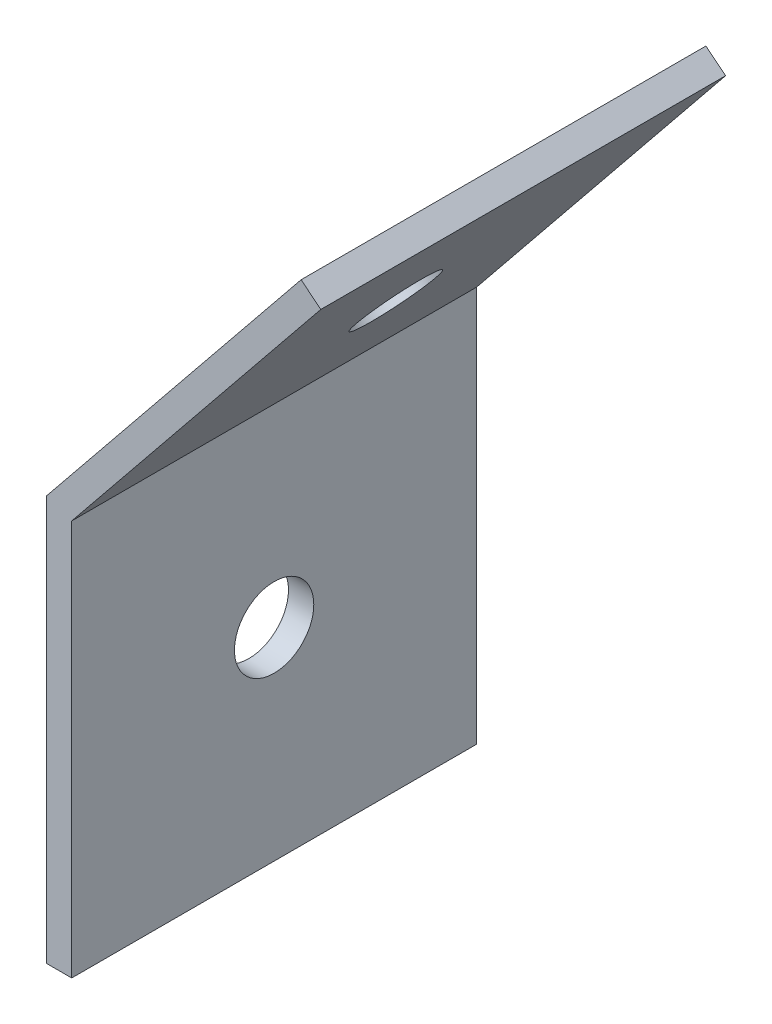
ISO-10303-21;
HEADER;
FILE_DESCRIPTION(('STEP AP214'),'2;1');
FILE_NAME('part.step','',(''),(''),'','','');
FILE_SCHEMA(('AUTOMOTIVE_DESIGN { 1 0 10303 214 1 1 1 1 }'));
ENDSEC;
DATA;
#1=APPLICATION_CONTEXT('core data for automotive mechanical design processes');
#2=APPLICATION_PROTOCOL_DEFINITION('international standard','automotive_design',2000,#1);
#3=PRODUCT_CONTEXT('',#1,'mechanical');
#4=PRODUCT('Part','Part','',(#3));
#5=PRODUCT_RELATED_PRODUCT_CATEGORY('part','',(#4));
#6=PRODUCT_DEFINITION_FORMATION('','',#4);
#7=PRODUCT_DEFINITION_CONTEXT('part definition',#1,'design');
#8=PRODUCT_DEFINITION('design','',#6,#7);
#9=PRODUCT_DEFINITION_SHAPE('','',#8);
#10=(LENGTH_UNIT() NAMED_UNIT(*) SI_UNIT(.MILLI.,.METRE.));
#11=(NAMED_UNIT(*) PLANE_ANGLE_UNIT() SI_UNIT($,.RADIAN.));
#12=(NAMED_UNIT(*) SI_UNIT($,.STERADIAN.) SOLID_ANGLE_UNIT());
#13=UNCERTAINTY_MEASURE_WITH_UNIT(LENGTH_MEASURE(1.E-05),#10,'distance_accuracy_value','');
#14=(GEOMETRIC_REPRESENTATION_CONTEXT(3) GLOBAL_UNCERTAINTY_ASSIGNED_CONTEXT((#13)) GLOBAL_UNIT_ASSIGNED_CONTEXT((#10,
#11,#12)) REPRESENTATION_CONTEXT('',''));
#15=CARTESIAN_POINT('',(0.,0.,0.));
#16=DIRECTION('',(0.,0.,1.));
#17=DIRECTION('',(1.,0.,0.));
#18=AXIS2_PLACEMENT_3D('',#15,#16,#17);
#19=CARTESIAN_POINT('',(0.,0.,-25.4));
#20=DIRECTION('',(-1.,0.,0.));
#21=DIRECTION('',(0.,-1.,0.));
#22=AXIS2_PLACEMENT_3D('',#19,#20,#21);
#23=PLANE('',#22);
#24=CARTESIAN_POINT('',(0.,-12.7,-12.7));
#25=DIRECTION('',(-1.,0.,0.));
#26=DIRECTION('',(0.,-1.,0.));
#27=AXIS2_PLACEMENT_3D('',#24,#25,#26);
#28=CIRCLE('',#27,2.48919999999999);
#29=CARTESIAN_POINT('',(0.,-15.1892,-12.7));
#30=VERTEX_POINT('',#29);
#31=EDGE_CURVE('E185',#30,#30,#28,.T.);
#32=ORIENTED_EDGE('',*,*,#31,.F.);
#33=EDGE_LOOP('',(#32));
#34=FACE_BOUND('',#33,.T.);
#35=DIRECTION('',(0.,-1.,0.));
#36=VECTOR('',#35,1.);
#37=CARTESIAN_POINT('',(0.,0.,0.));
#38=LINE('',#37,#36);
#39=CARTESIAN_POINT('',(0.,0.,0.));
#40=VERTEX_POINT('',#39);
#41=CARTESIAN_POINT('',(0.,-25.4,0.));
#42=VERTEX_POINT('',#41);
#43=EDGE_CURVE('E116',#40,#42,#38,.T.);
#44=ORIENTED_EDGE('',*,*,#43,.F.);
#45=DIRECTION('',(0.,0.,1.));
#46=VECTOR('',#45,1.);
#47=CARTESIAN_POINT('',(0.,0.,-25.4));
#48=LINE('',#47,#46);
#49=CARTESIAN_POINT('',(0.,0.,-25.4));
#50=VERTEX_POINT('',#49);
#51=EDGE_CURVE('E11',#50,#40,#48,.T.);
#52=ORIENTED_EDGE('',*,*,#51,.F.);
#53=DIRECTION('',(0.,-1.,0.));
#54=VECTOR('',#53,1.);
#55=CARTESIAN_POINT('',(0.,0.,-25.4));
#56=LINE('',#55,#54);
#57=CARTESIAN_POINT('',(0.,-25.4,-25.4));
#58=VERTEX_POINT('',#57);
#59=EDGE_CURVE('E130',#50,#58,#56,.T.);
#60=ORIENTED_EDGE('',*,*,#59,.T.);
#61=DIRECTION('',(0.,0.,1.));
#62=VECTOR('',#61,1.);
#63=CARTESIAN_POINT('',(0.,-25.4,-25.4));
#64=LINE('',#63,#62);
#65=EDGE_CURVE('E37',#58,#42,#64,.T.);
#66=ORIENTED_EDGE('',*,*,#65,.T.);
#67=EDGE_LOOP('',(#44,#52,#60,#66));
#68=FACE_BOUND('',#67,.T.);
#69=ADVANCED_FACE('F34',(#34,#68),#23,.T.);
#70=CARTESIAN_POINT('',(0.,0.,-25.4));
#71=DIRECTION('',(-0.777233462324333,0.629212321115321,0.));
#72=DIRECTION('',(-0.629212321115321,-0.777233462324333,0.));
#73=AXIS2_PLACEMENT_3D('',#70,#71,#72);
#74=PLANE('',#73);
#75=CARTESIAN_POINT('',(7.99099647816458,9.87086497151904,-12.7));
#76=DIRECTION('',(-0.777233462324333,0.629212321115321,0.));
#77=DIRECTION('',(-0.629212321115321,-0.777233462324333,0.));
#78=AXIS2_PLACEMENT_3D('',#75,#76,#77);
#79=CIRCLE('',#78,2.48919999999999);
#80=CARTESIAN_POINT('',(6.42476116844433,7.93617543710132,-12.7));
#81=VERTEX_POINT('',#80);
#82=EDGE_CURVE('E120',#81,#81,#79,.T.);
#83=ORIENTED_EDGE('',*,*,#82,.F.);
#84=EDGE_LOOP('',(#83));
#85=FACE_BOUND('',#84,.T.);
#86=DIRECTION('',(-0.629212321115321,-0.777233462324333,0.));
#87=VECTOR('',#86,1.);
#88=CARTESIAN_POINT('',(0.,0.,0.));
#89=LINE('',#88,#87);
#90=CARTESIAN_POINT('',(15.9819929563291,19.7417299430381,0.));
#91=VERTEX_POINT('',#90);
#92=EDGE_CURVE('E128',#91,#40,#89,.T.);
#93=ORIENTED_EDGE('',*,*,#92,.F.);
#94=DIRECTION('',(0.,0.,1.));
#95=VECTOR('',#94,1.);
#96=CARTESIAN_POINT('',(15.9819929563291,19.7417299430381,-25.4));
#97=LINE('',#96,#95);
#98=CARTESIAN_POINT('',(15.9819929563291,19.7417299430381,-25.4));
#99=VERTEX_POINT('',#98);
#100=EDGE_CURVE('E43',#99,#91,#97,.T.);
#101=ORIENTED_EDGE('',*,*,#100,.F.);
#102=DIRECTION('',(-0.629212321115321,-0.777233462324333,0.));
#103=VECTOR('',#102,1.);
#104=CARTESIAN_POINT('',(0.,0.,-25.4));
#105=LINE('',#104,#103);
#106=EDGE_CURVE('E97',#99,#50,#105,.T.);
#107=ORIENTED_EDGE('',*,*,#106,.T.);
#108=ORIENTED_EDGE('',*,*,#51,.T.);
#109=EDGE_LOOP('',(#93,#101,#107,#108));
#110=FACE_BOUND('',#109,.T.);
#111=ADVANCED_FACE('F142',(#85,#110),#74,.T.);
#112=CARTESIAN_POINT('',(15.9819929563291,19.7417299430381,-25.4));
#113=DIRECTION('',(-0.629212321115316,-0.777233462324337,0.));
#114=DIRECTION('',(0.777233462324337,-0.629212321115316,0.));
#115=AXIS2_PLACEMENT_3D('',#112,#113,#114);
#116=PLANE('',#115);
#117=DIRECTION('',(0.777233462324337,-0.629212321115316,0.));
#118=VECTOR('',#117,1.);
#119=CARTESIAN_POINT('',(15.9819929563291,19.7417299430381,0.));
#120=LINE('',#119,#118);
#121=CARTESIAN_POINT('',(17.215851077769,18.7428553832675,0.));
#122=VERTEX_POINT('',#121);
#123=EDGE_CURVE('E102',#91,#122,#120,.T.);
#124=ORIENTED_EDGE('',*,*,#123,.T.);
#125=DIRECTION('',(0.,0.,1.));
#126=VECTOR('',#125,1.);
#127=CARTESIAN_POINT('',(17.215851077769,18.7428553832675,-25.4));
#128=LINE('',#127,#126);
#129=CARTESIAN_POINT('',(17.215851077769,18.7428553832675,-25.4));
#130=VERTEX_POINT('',#129);
#131=EDGE_CURVE('E100',#130,#122,#128,.T.);
#132=ORIENTED_EDGE('',*,*,#131,.F.);
#133=DIRECTION('',(0.777233462324337,-0.629212321115316,0.));
#134=VECTOR('',#133,1.);
#135=CARTESIAN_POINT('',(15.9819929563291,19.7417299430381,-25.4));
#136=LINE('',#135,#134);
#137=EDGE_CURVE('E91',#99,#130,#136,.T.);
#138=ORIENTED_EDGE('',*,*,#137,.F.);
#139=ORIENTED_EDGE('',*,*,#100,.T.);
#140=EDGE_LOOP('',(#124,#132,#138,#139));
#141=FACE_BOUND('',#140,.T.);
#142=ADVANCED_FACE('F101',(#141),#116,.F.);
#143=CARTESIAN_POINT('',(1.23385812143988,-0.998874559770572,-25.4));
#144=DIRECTION('',(-0.777233462324333,0.629212321115321,0.));
#145=DIRECTION('',(-0.629212321115321,-0.777233462324333,0.));
#146=AXIS2_PLACEMENT_3D('',#143,#144,#145);
#147=PLANE('',#146);
#148=CARTESIAN_POINT('',(9.22485459960446,8.87199041174847,-12.7));
#149=DIRECTION('',(0.777233462324333,-0.629212321115321,0.));
#150=DIRECTION('',(0.629212321115321,0.777233462324333,0.));
#151=AXIS2_PLACEMENT_3D('',#148,#149,#150);
#152=CIRCLE('',#151,2.48919999999999);
#153=CARTESIAN_POINT('',(10.7910899093247,10.8066799461662,-12.7));
#154=VERTEX_POINT('',#153);
#155=EDGE_CURVE('E186',#154,#154,#152,.T.);
#156=ORIENTED_EDGE('',*,*,#155,.F.);
#157=EDGE_LOOP('',(#156));
#158=FACE_BOUND('',#157,.T.);
#159=DIRECTION('',(-0.629212321115321,-0.777233462324333,0.));
#160=VECTOR('',#159,1.);
#161=CARTESIAN_POINT('',(1.23385812143988,-0.998874559770572,0.));
#162=LINE('',#161,#160);
#163=CARTESIAN_POINT('',(1.5875,-0.562039023541792,0.));
#164=VERTEX_POINT('',#163);
#165=EDGE_CURVE('E125',#122,#164,#162,.T.);
#166=ORIENTED_EDGE('',*,*,#165,.T.);
#167=DIRECTION('',(0.,0.,1.));
#168=VECTOR('',#167,1.);
#169=CARTESIAN_POINT('',(1.5875,-0.562039023541792,-25.4));
#170=LINE('',#169,#168);
#171=CARTESIAN_POINT('',(1.5875,-0.562039023541792,-25.4));
#172=VERTEX_POINT('',#171);
#173=EDGE_CURVE('E105',#172,#164,#170,.T.);
#174=ORIENTED_EDGE('',*,*,#173,.F.);
#175=DIRECTION('',(-0.629212321115321,-0.777233462324333,0.));
#176=VECTOR('',#175,1.);
#177=CARTESIAN_POINT('',(1.23385812143988,-0.998874559770572,-25.4));
#178=LINE('',#177,#176);
#179=EDGE_CURVE('E95',#130,#172,#178,.T.);
#180=ORIENTED_EDGE('',*,*,#179,.F.);
#181=ORIENTED_EDGE('',*,*,#131,.T.);
#182=EDGE_LOOP('',(#166,#174,#180,#181));
#183=FACE_BOUND('',#182,.T.);
#184=ADVANCED_FACE('F107',(#158,#183),#147,.F.);
#185=CARTESIAN_POINT('',(1.5875,0.,-25.4));
#186=DIRECTION('',(-1.,0.,0.));
#187=DIRECTION('',(0.,-1.,0.));
#188=AXIS2_PLACEMENT_3D('',#185,#186,#187);
#189=PLANE('',#188);
#190=CARTESIAN_POINT('',(1.58750000000005,-12.7,-12.7));
#191=DIRECTION('',(1.,0.,0.));
#192=DIRECTION('',(0.,0.,-1.));
#193=AXIS2_PLACEMENT_3D('',#190,#191,#192);
#194=CIRCLE('',#193,2.48919999999999);
#195=CARTESIAN_POINT('',(1.58750000000005,-12.7,-15.1892));
#196=VERTEX_POINT('',#195);
#197=EDGE_CURVE('E182',#196,#196,#194,.T.);
#198=ORIENTED_EDGE('',*,*,#197,.F.);
#199=EDGE_LOOP('',(#198));
#200=FACE_BOUND('',#199,.T.);
#201=DIRECTION('',(0.,-1.,0.));
#202=VECTOR('',#201,1.);
#203=CARTESIAN_POINT('',(1.5875,0.,0.));
#204=LINE('',#203,#202);
#205=CARTESIAN_POINT('',(1.5875000000001,-25.4,0.));
#206=VERTEX_POINT('',#205);
#207=EDGE_CURVE('E123',#164,#206,#204,.T.);
#208=ORIENTED_EDGE('',*,*,#207,.T.);
#209=DIRECTION('',(0.,0.,1.));
#210=VECTOR('',#209,1.);
#211=CARTESIAN_POINT('',(1.5875000000001,-25.4,-25.4));
#212=LINE('',#211,#210);
#213=CARTESIAN_POINT('',(1.5875000000001,-25.4,-25.4));
#214=VERTEX_POINT('',#213);
#215=EDGE_CURVE('E133',#214,#206,#212,.T.);
#216=ORIENTED_EDGE('',*,*,#215,.F.);
#217=DIRECTION('',(0.,-1.,0.));
#218=VECTOR('',#217,1.);
#219=CARTESIAN_POINT('',(1.5875,0.,-25.4));
#220=LINE('',#219,#218);
#221=EDGE_CURVE('E110',#172,#214,#220,.T.);
#222=ORIENTED_EDGE('',*,*,#221,.F.);
#223=ORIENTED_EDGE('',*,*,#173,.T.);
#224=EDGE_LOOP('',(#208,#216,#222,#223));
#225=FACE_BOUND('',#224,.T.);
#226=ADVANCED_FACE('F158',(#200,#225),#189,.F.);
#227=CARTESIAN_POINT('',(1.5875000000001,-25.4,-25.4));
#228=DIRECTION('',(0.,1.,0.));
#229=DIRECTION('',(-1.,0.,0.));
#230=AXIS2_PLACEMENT_3D('',#227,#228,#229);
#231=PLANE('',#230);
#232=DIRECTION('',(-1.,0.,0.));
#233=VECTOR('',#232,1.);
#234=CARTESIAN_POINT('',(1.5875000000001,-25.4,0.));
#235=LINE('',#234,#233);
#236=EDGE_CURVE('E119',#206,#42,#235,.T.);
#237=ORIENTED_EDGE('',*,*,#236,.T.);
#238=ORIENTED_EDGE('',*,*,#65,.F.);
#239=DIRECTION('',(-1.,0.,0.));
#240=VECTOR('',#239,1.);
#241=CARTESIAN_POINT('',(1.5875000000001,-25.4,-25.4));
#242=LINE('',#241,#240);
#243=EDGE_CURVE('E83',#214,#58,#242,.T.);
#244=ORIENTED_EDGE('',*,*,#243,.F.);
#245=ORIENTED_EDGE('',*,*,#215,.T.);
#246=EDGE_LOOP('',(#237,#238,#244,#245));
#247=FACE_BOUND('',#246,.T.);
#248=ADVANCED_FACE('F138',(#247),#231,.F.);
#249=CARTESIAN_POINT('',(0.,0.,-25.4));
#250=DIRECTION('',(0.,0.,-1.));
#251=DIRECTION('',(-1.,0.,0.));
#252=AXIS2_PLACEMENT_3D('',#249,#250,#251);
#253=PLANE('',#252);
#254=ORIENTED_EDGE('',*,*,#59,.F.);
#255=ORIENTED_EDGE('',*,*,#106,.F.);
#256=ORIENTED_EDGE('',*,*,#137,.T.);
#257=ORIENTED_EDGE('',*,*,#179,.T.);
#258=ORIENTED_EDGE('',*,*,#221,.T.);
#259=ORIENTED_EDGE('',*,*,#243,.T.);
#260=EDGE_LOOP('',(#254,#255,#256,#257,#258,#259));
#261=FACE_BOUND('',#260,.T.);
#262=ADVANCED_FACE('F93',(#261),#253,.T.);
#263=CARTESIAN_POINT('',(0.,0.,0.));
#264=DIRECTION('',(0.,0.,-1.));
#265=DIRECTION('',(-1.,0.,0.));
#266=AXIS2_PLACEMENT_3D('',#263,#264,#265);
#267=PLANE('',#266);
#268=ORIENTED_EDGE('',*,*,#43,.T.);
#269=ORIENTED_EDGE('',*,*,#236,.F.);
#270=ORIENTED_EDGE('',*,*,#207,.F.);
#271=ORIENTED_EDGE('',*,*,#165,.F.);
#272=ORIENTED_EDGE('',*,*,#123,.F.);
#273=ORIENTED_EDGE('',*,*,#92,.T.);
#274=EDGE_LOOP('',(#268,#269,#270,#271,#272,#273));
#275=FACE_BOUND('',#274,.T.);
#276=ADVANCED_FACE('F141',(#275),#267,.F.);
#277=CARTESIAN_POINT('',(9.22485459960446,8.87199041174847,-12.7));
#278=DIRECTION('',(0.777233462324333,-0.629212321115321,0.));
#279=DIRECTION('',(0.629212321115321,0.777233462324333,0.));
#280=AXIS2_PLACEMENT_3D('',#277,#278,#279);
#281=CYLINDRICAL_SURFACE('',#280,2.48919999999999);
#282=ORIENTED_EDGE('',*,*,#155,.T.);
#283=EDGE_LOOP('',(#282));
#284=FACE_BOUND('',#283,.T.);
#285=ORIENTED_EDGE('',*,*,#82,.T.);
#286=EDGE_LOOP('',(#285));
#287=FACE_BOUND('',#286,.T.);
#288=ADVANCED_FACE('F169',(#284,#287),#281,.F.);
#289=CARTESIAN_POINT('',(1.58750000000005,-12.7,-12.7));
#290=DIRECTION('',(1.,0.,0.));
#291=DIRECTION('',(0.,0.,-1.));
#292=AXIS2_PLACEMENT_3D('',#289,#290,#291);
#293=CYLINDRICAL_SURFACE('',#292,2.48919999999999);
#294=ORIENTED_EDGE('',*,*,#197,.T.);
#295=EDGE_LOOP('',(#294));
#296=FACE_BOUND('',#295,.T.);
#297=ORIENTED_EDGE('',*,*,#31,.T.);
#298=EDGE_LOOP('',(#297));
#299=FACE_BOUND('',#298,.T.);
#300=ADVANCED_FACE('F173',(#296,#299),#293,.F.);
#301=CLOSED_SHELL('',(#69,#111,#142,#184,#226,#248,#262,#276,#288,#300));
#302=MANIFOLD_SOLID_BREP('B2',#301);
#303=ADVANCED_BREP_SHAPE_REPRESENTATION('',(#18,#302),#14);
#304=SHAPE_DEFINITION_REPRESENTATION(#9,#303);
ENDSEC;
END-ISO-10303-21;
